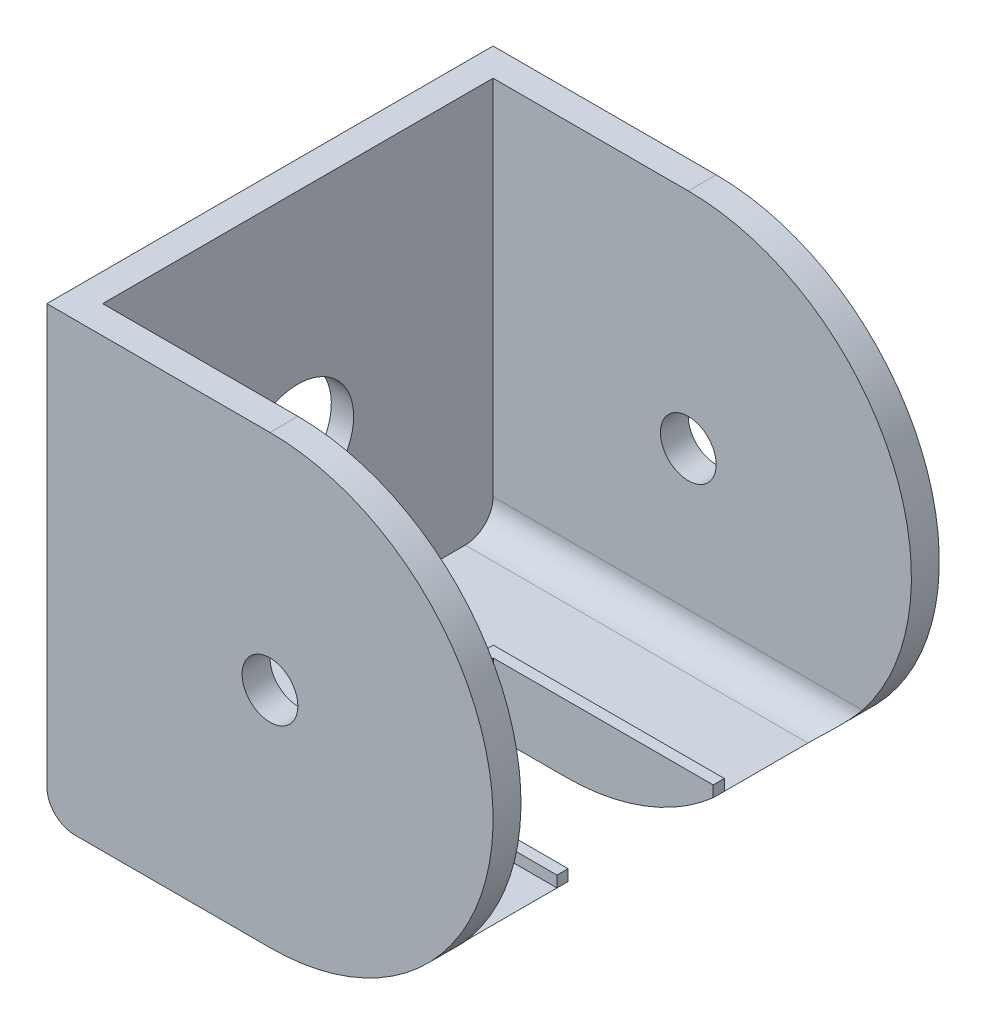
ISO-10303-21;
HEADER;
FILE_DESCRIPTION(('STEP AP214'),'2;1');
FILE_NAME('part.step','',(''),(''),'','','');
FILE_SCHEMA(('AUTOMOTIVE_DESIGN { 1 0 10303 214 1 1 1 1 }'));
ENDSEC;
DATA;
#1=APPLICATION_CONTEXT('core data for automotive mechanical design processes');
#2=APPLICATION_PROTOCOL_DEFINITION('international standard','automotive_design',2000,#1);
#3=PRODUCT_CONTEXT('',#1,'mechanical');
#4=PRODUCT('Part','Part','',(#3));
#5=PRODUCT_RELATED_PRODUCT_CATEGORY('part','',(#4));
#6=PRODUCT_DEFINITION_FORMATION('','',#4);
#7=PRODUCT_DEFINITION_CONTEXT('part definition',#1,'design');
#8=PRODUCT_DEFINITION('design','',#6,#7);
#9=PRODUCT_DEFINITION_SHAPE('','',#8);
#10=(LENGTH_UNIT() NAMED_UNIT(*) SI_UNIT(.MILLI.,.METRE.));
#11=(NAMED_UNIT(*) PLANE_ANGLE_UNIT() SI_UNIT($,.RADIAN.));
#12=(NAMED_UNIT(*) SI_UNIT($,.STERADIAN.) SOLID_ANGLE_UNIT());
#13=UNCERTAINTY_MEASURE_WITH_UNIT(LENGTH_MEASURE(1.E-05),#10,'distance_accuracy_value','');
#14=(GEOMETRIC_REPRESENTATION_CONTEXT(3) GLOBAL_UNCERTAINTY_ASSIGNED_CONTEXT((#13)) GLOBAL_UNIT_ASSIGNED_CONTEXT((#10,
#11,#12)) REPRESENTATION_CONTEXT('',''));
#15=CARTESIAN_POINT('',(0.,0.,0.));
#16=DIRECTION('',(0.,0.,1.));
#17=DIRECTION('',(1.,0.,0.));
#18=AXIS2_PLACEMENT_3D('',#15,#16,#17);
#19=CARTESIAN_POINT('',(-2.70461538461543,-30.,75.));
#20=DIRECTION('',(0.,-1.,0.));
#21=DIRECTION('',(0.,0.,-1.));
#22=AXIS2_PLACEMENT_3D('',#19,#20,#21);
#23=PLANE('',#22);
#24=DIRECTION('',(0.,0.,-1.));
#25=VECTOR('',#24,1.);
#26=CARTESIAN_POINT('',(58.7528977260305,-30.,75.));
#27=LINE('',#26,#25);
#28=CARTESIAN_POINT('',(58.7528977260305,-30.,25.));
#29=VERTEX_POINT('',#28);
#30=CARTESIAN_POINT('',(58.7528977260305,-30.,9.99999999999999));
#31=VERTEX_POINT('',#30);
#32=EDGE_CURVE('E248',#29,#31,#27,.T.);
#33=ORIENTED_EDGE('',*,*,#32,.T.);
#34=DIRECTION('',(-1.,0.,0.));
#35=VECTOR('',#34,1.);
#36=CARTESIAN_POINT('',(-2.70461538461543,-30.,9.99999999999999));
#37=LINE('',#36,#35);
#38=CARTESIAN_POINT('',(-2.70461538461543,-30.,9.99999999999999));
#39=VERTEX_POINT('',#38);
#40=EDGE_CURVE('E325',#31,#39,#37,.T.);
#41=ORIENTED_EDGE('',*,*,#40,.T.);
#42=DIRECTION('',(0.,0.,-1.));
#43=VECTOR('',#42,1.);
#44=CARTESIAN_POINT('',(-2.70461538461543,-30.,75.));
#45=LINE('',#44,#43);
#46=CARTESIAN_POINT('',(-2.70461538461543,-30.,70.));
#47=VERTEX_POINT('',#46);
#48=EDGE_CURVE('E245',#47,#39,#45,.T.);
#49=ORIENTED_EDGE('',*,*,#48,.F.);
#50=DIRECTION('',(-1.,0.,0.));
#51=VECTOR('',#50,1.);
#52=CARTESIAN_POINT('',(-2.70461538461543,-30.,70.));
#53=LINE('',#52,#51);
#54=CARTESIAN_POINT('',(58.7528977260305,-30.,70.));
#55=VERTEX_POINT('',#54);
#56=EDGE_CURVE('E323',#47,#55,#53,.F.);
#57=ORIENTED_EDGE('',*,*,#56,.T.);
#58=CARTESIAN_POINT('',(58.7528977260305,-30.,55.));
#59=VERTEX_POINT('',#58);
#60=EDGE_CURVE('E249',#55,#59,#27,.T.);
#61=ORIENTED_EDGE('',*,*,#60,.T.);
#62=DIRECTION('',(1.,0.,0.));
#63=VECTOR('',#62,1.);
#64=CARTESIAN_POINT('',(58.7528977260305,-30.,55.));
#65=LINE('',#64,#63);
#66=CARTESIAN_POINT('',(17.3396899794099,-30.,55.));
#67=VERTEX_POINT('',#66);
#68=EDGE_CURVE('E208',#67,#59,#65,.T.);
#69=ORIENTED_EDGE('',*,*,#68,.F.);
#70=DIRECTION('',(0.,0.,1.));
#71=VECTOR('',#70,1.);
#72=CARTESIAN_POINT('',(17.3396899794099,-30.,55.));
#73=LINE('',#72,#71);
#74=CARTESIAN_POINT('',(17.3396899794099,-30.,25.));
#75=VERTEX_POINT('',#74);
#76=EDGE_CURVE('E460',#75,#67,#73,.T.);
#77=ORIENTED_EDGE('',*,*,#76,.F.);
#78=DIRECTION('',(-1.,0.,0.));
#79=VECTOR('',#78,1.);
#80=CARTESIAN_POINT('',(17.3396899794099,-30.,25.));
#81=LINE('',#80,#79);
#82=EDGE_CURVE('E458',#29,#75,#81,.T.);
#83=ORIENTED_EDGE('',*,*,#82,.F.);
#84=EDGE_LOOP('',(#33,#41,#49,#57,#61,#69,#77,#83));
#85=FACE_BOUND('',#84,.T.);
#86=ADVANCED_FACE('F44',(#85),#23,.F.);
#87=CARTESIAN_POINT('',(32.2953846153846,0.,5.));
#88=DIRECTION('',(0.,0.,-1.));
#89=DIRECTION('',(-1.,0.,0.));
#90=AXIS2_PLACEMENT_3D('',#87,#88,#89);
#91=CYLINDRICAL_SURFACE('',#90,40.);
#92=CARTESIAN_POINT('',(58.7528977260305,-30.,27.));
#93=VERTEX_POINT('',#92);
#94=EDGE_CURVE('E252',#93,#29,#27,.T.);
#95=ORIENTED_EDGE('',*,*,#94,.F.);
#96=CARTESIAN_POINT('',(32.2953846153846,0.,27.));
#97=DIRECTION('',(0.,0.,-1.));
#98=DIRECTION('',(-1.,0.,0.));
#99=AXIS2_PLACEMENT_3D('',#96,#97,#98);
#100=CIRCLE('',#99,40.);
#101=CARTESIAN_POINT('',(32.2953846153846,-40.,27.));
#102=VERTEX_POINT('',#101);
#103=EDGE_CURVE('E227',#93,#102,#100,.T.);
#104=ORIENTED_EDGE('',*,*,#103,.T.);
#105=DIRECTION('',(0.,0.,-1.));
#106=VECTOR('',#105,1.);
#107=CARTESIAN_POINT('',(32.2953846153846,-40.,5.));
#108=LINE('',#107,#106);
#109=CARTESIAN_POINT('',(32.2953846153846,-40.,0.));
#110=VERTEX_POINT('',#109);
#111=EDGE_CURVE('E308',#102,#110,#108,.T.);
#112=ORIENTED_EDGE('',*,*,#111,.T.);
#113=CARTESIAN_POINT('',(32.2953846153846,0.,0.));
#114=DIRECTION('',(0.,0.,1.));
#115=DIRECTION('',(1.,0.,0.));
#116=AXIS2_PLACEMENT_3D('',#113,#114,#115);
#117=CIRCLE('',#116,40.);
#118=CARTESIAN_POINT('',(32.2953846153846,40.,0.));
#119=VERTEX_POINT('',#118);
#120=EDGE_CURVE('E299',#110,#119,#117,.T.);
#121=ORIENTED_EDGE('',*,*,#120,.T.);
#122=DIRECTION('',(0.,0.,-1.));
#123=VECTOR('',#122,1.);
#124=CARTESIAN_POINT('',(32.2953846153846,40.,5.));
#125=LINE('',#124,#123);
#126=CARTESIAN_POINT('',(32.2953846153846,40.,5.));
#127=VERTEX_POINT('',#126);
#128=EDGE_CURVE('E306',#127,#119,#125,.T.);
#129=ORIENTED_EDGE('',*,*,#128,.F.);
#130=CARTESIAN_POINT('',(32.2953846153846,0.,5.));
#131=DIRECTION('',(0.,0.,1.));
#132=DIRECTION('',(1.,0.,0.));
#133=AXIS2_PLACEMENT_3D('',#130,#131,#132);
#134=CIRCLE('',#133,40.);
#135=CARTESIAN_POINT('',(63.5203746073766,-25.,5.));
#136=VERTEX_POINT('',#135);
#137=EDGE_CURVE('E286',#136,#127,#134,.T.);
#138=ORIENTED_EDGE('',*,*,#137,.F.);
#139=CARTESIAN_POINT('',(63.5203746073766,-25.,5.));
#140=CARTESIAN_POINT('',(63.3885852431773,-25.1646251545152,5.00001957940437));
#141=CARTESIAN_POINT('',(63.2554983068493,-25.3281629039688,5.00812986784931));
#142=CARTESIAN_POINT('',(62.9875617451999,-25.6521768028362,5.04003944373569));
#143=CARTESIAN_POINT('',(62.852712548848,-25.8126536747696,5.06383498031415));
#144=CARTESIAN_POINT('',(62.5810553749061,-26.1308686673881,5.12684689389359));
#145=CARTESIAN_POINT('',(62.444240286586,-26.2885791116842,5.16617198463156));
#146=CARTESIAN_POINT('',(62.1704367686102,-26.5993258334251,5.25990483661994));
#147=CARTESIAN_POINT('',(62.0334483196032,-26.7523615301786,5.3143144632625));
#148=CARTESIAN_POINT('',(61.7442950859481,-27.0705206270654,5.44523471196293));
#149=CARTESIAN_POINT('',(61.5922212118042,-27.2349756111878,5.52358147685888));
#150=CARTESIAN_POINT('',(61.2904165968373,-27.5560643288028,5.69883706245595));
#151=CARTESIAN_POINT('',(61.1406864604896,-27.7126960666944,5.79575058909986));
#152=CARTESIAN_POINT('',(60.8457061244488,-28.0164921579936,6.0081282251765));
#153=CARTESIAN_POINT('',(60.7004456923563,-28.1636791273149,6.1235455137348));
#154=CARTESIAN_POINT('',(60.4163173376673,-28.4473800838824,6.37352864869472));
#155=CARTESIAN_POINT('',(60.2774451230508,-28.5839012814606,6.50808138243117));
#156=CARTESIAN_POINT('',(59.983479710536,-28.8689922717649,6.82440562670511));
#157=CARTESIAN_POINT('',(59.830255858781,-29.0149904374167,7.01029763244727));
#158=CARTESIAN_POINT('',(59.5434759993451,-29.2844693023306,7.41126457065981));
#159=CARTESIAN_POINT('',(59.409891822543,-29.4079823138116,7.62629683894708));
#160=CARTESIAN_POINT('',(59.1971535184453,-29.6025510845106,8.03626883062401));
#161=CARTESIAN_POINT('',(59.112471072184,-29.6791759281358,8.22560770662185));
#162=CARTESIAN_POINT('',(59.0031339074154,-29.7774835939238,8.52133638723915));
#163=CARTESIAN_POINT('',(58.96965529091,-29.8074641932619,8.62178259892865));
#164=CARTESIAN_POINT('',(58.909252522934,-29.861407811779,8.82617622301221));
#165=CARTESIAN_POINT('',(58.8823244695348,-29.8853744135437,8.93012150891989));
#166=CARTESIAN_POINT('',(58.8417434150685,-29.9214198556453,9.11346308221666));
#167=CARTESIAN_POINT('',(58.8264592365768,-29.9349693718543,9.19221541714233));
#168=CARTESIAN_POINT('',(58.8000627737806,-29.9583435028514,9.35095227810625));
#169=CARTESIAN_POINT('',(58.7889495250369,-29.9681689787501,9.43093651483476));
#170=CARTESIAN_POINT('',(58.77102948682,-29.9840020850262,9.59218518230865));
#171=CARTESIAN_POINT('',(58.7642452237779,-29.9899897455521,9.67345409017326));
#172=CARTESIAN_POINT('',(58.7551713768924,-29.9979947813036,9.8364794634789));
#173=CARTESIAN_POINT('',(58.7528841833329,-30.000010045121,9.91823616504953));
#174=CARTESIAN_POINT('',(58.7528977260305,-30.,9.99999999999999));
#175=B_SPLINE_CURVE_WITH_KNOTS('',3,(#139,#140,#141,#142,#143,#144,#145,#146,#147,#148,#149,
#150,#151,#152,#153,#154,#155,#156,#157,#158,#159,#160,#161,#162,#163,#164,#165,#166,#167,#168,
#169,#170,#171,#172,#173,#174),.UNSPECIFIED.,.F.,.F.,(4,2,2,2,2,2,2,2,2,2,2,2,2,2,2,2,2,4),(0.,
0.632420277945506,1.26468937806841,1.90146541807382,2.53832023857879,3.2493576937015,
3.96057560781467,4.67002150382291,5.37898357002722,6.22143887904661,7.06267381547257,
7.72326568764131,8.05304444022069,8.3826262721165,8.62651693104416,8.87035116062598,
9.11544408246242,9.36066724098931),.UNSPECIFIED.);
#176=EDGE_CURVE('E58',#136,#31,#175,.T.);
#177=ORIENTED_EDGE('',*,*,#176,.T.);
#178=ORIENTED_EDGE('',*,*,#32,.F.);
#179=EDGE_LOOP('',(#95,#104,#112,#121,#129,#138,#177,#178));
#180=FACE_BOUND('',#179,.T.);
#181=ADVANCED_FACE('F367',(#180),#91,.T.);
#182=CARTESIAN_POINT('',(-2.70461538461543,0.,40.));
#183=DIRECTION('',(-1.,0.,0.));
#184=DIRECTION('',(0.,-1.,0.));
#185=AXIS2_PLACEMENT_3D('',#182,#183,#184);
#186=CYLINDRICAL_SURFACE('',#185,10.);
#187=CARTESIAN_POINT('',(-2.70461538461543,0.,40.));
#188=DIRECTION('',(-1.,0.,0.));
#189=DIRECTION('',(0.,-1.,0.));
#190=AXIS2_PLACEMENT_3D('',#187,#188,#189);
#191=CIRCLE('',#190,10.);
#192=CARTESIAN_POINT('',(-2.70461538461542,-10.,40.));
#193=VERTEX_POINT('',#192);
#194=EDGE_CURVE('E242',#193,#193,#191,.T.);
#195=ORIENTED_EDGE('',*,*,#194,.F.);
#196=EDGE_LOOP('',(#195));
#197=FACE_BOUND('',#196,.T.);
#198=CARTESIAN_POINT('',(-6.70461538461543,0.,40.));
#199=DIRECTION('',(-1.,0.,0.));
#200=DIRECTION('',(0.,-1.,0.));
#201=AXIS2_PLACEMENT_3D('',#198,#199,#200);
#202=CIRCLE('',#201,10.);
#203=CARTESIAN_POINT('',(-6.70461538461543,-10.,40.));
#204=VERTEX_POINT('',#203);
#205=EDGE_CURVE('E239',#204,#204,#202,.F.);
#206=ORIENTED_EDGE('',*,*,#205,.F.);
#207=EDGE_LOOP('',(#206));
#208=FACE_BOUND('',#207,.T.);
#209=ADVANCED_FACE('F375',(#197,#208),#186,.F.);
#210=CARTESIAN_POINT('',(0.,0.,5.));
#211=DIRECTION('',(0.,0.,1.));
#212=DIRECTION('',(1.,0.,0.));
#213=AXIS2_PLACEMENT_3D('',#210,#211,#212);
#214=PLANE('',#213);
#215=CARTESIAN_POINT('',(32.2953846153846,0.,5.));
#216=DIRECTION('',(0.,0.,1.));
#217=DIRECTION('',(1.,0.,0.));
#218=AXIS2_PLACEMENT_3D('',#215,#216,#217);
#219=CIRCLE('',#218,5.);
#220=CARTESIAN_POINT('',(37.2953846153846,0.,5.));
#221=VERTEX_POINT('',#220);
#222=EDGE_CURVE('E283',#221,#221,#219,.T.);
#223=ORIENTED_EDGE('',*,*,#222,.F.);
#224=EDGE_LOOP('',(#223));
#225=FACE_BOUND('',#224,.T.);
#226=DIRECTION('',(0.,1.,0.));
#227=VECTOR('',#226,1.);
#228=CARTESIAN_POINT('',(-2.70461538461543,40.,5.));
#229=LINE('',#228,#227);
#230=CARTESIAN_POINT('',(-2.70461538461542,-25.,5.));
#231=VERTEX_POINT('',#230);
#232=CARTESIAN_POINT('',(-2.70461538461543,40.,5.));
#233=VERTEX_POINT('',#232);
#234=EDGE_CURVE('E275',#231,#233,#229,.T.);
#235=ORIENTED_EDGE('',*,*,#234,.F.);
#236=DIRECTION('',(-1.,0.,0.));
#237=VECTOR('',#236,1.);
#238=CARTESIAN_POINT('',(0.,-25.,5.));
#239=LINE('',#238,#237);
#240=EDGE_CURVE('E71',#231,#136,#239,.F.);
#241=ORIENTED_EDGE('',*,*,#240,.T.);
#242=ORIENTED_EDGE('',*,*,#137,.T.);
#243=DIRECTION('',(1.,0.,0.));
#244=VECTOR('',#243,1.);
#245=CARTESIAN_POINT('',(0.,40.,5.));
#246=LINE('',#245,#244);
#247=EDGE_CURVE('E289',#233,#127,#246,.T.);
#248=ORIENTED_EDGE('',*,*,#247,.F.);
#249=EDGE_LOOP('',(#235,#241,#242,#248));
#250=FACE_BOUND('',#249,.T.);
#251=ADVANCED_FACE('F397',(#225,#250),#214,.T.);
#252=CARTESIAN_POINT('',(-2.70461538461543,40.,75.));
#253=DIRECTION('',(-1.,0.,0.));
#254=DIRECTION('',(0.,-1.,0.));
#255=AXIS2_PLACEMENT_3D('',#252,#253,#254);
#256=PLANE('',#255);
#257=ORIENTED_EDGE('',*,*,#194,.T.);
#258=EDGE_LOOP('',(#257));
#259=FACE_BOUND('',#258,.T.);
#260=ORIENTED_EDGE('',*,*,#48,.T.);
#261=CARTESIAN_POINT('',(-2.70461538461542,-25.,9.99999999999999));
#262=DIRECTION('',(-1.,0.,0.));
#263=DIRECTION('',(0.,-1.,0.));
#264=AXIS2_PLACEMENT_3D('',#261,#262,#263);
#265=CIRCLE('',#264,5.);
#266=EDGE_CURVE('E330',#39,#231,#265,.F.);
#267=ORIENTED_EDGE('',*,*,#266,.T.);
#268=ORIENTED_EDGE('',*,*,#234,.T.);
#269=DIRECTION('',(0.,0.,-1.));
#270=VECTOR('',#269,1.);
#271=CARTESIAN_POINT('',(-2.70461538461543,40.,75.));
#272=LINE('',#271,#270);
#273=CARTESIAN_POINT('',(-2.70461538461543,40.,75.));
#274=VERTEX_POINT('',#273);
#275=EDGE_CURVE('E278',#274,#233,#272,.T.);
#276=ORIENTED_EDGE('',*,*,#275,.F.);
#277=DIRECTION('',(0.,1.,0.));
#278=VECTOR('',#277,1.);
#279=CARTESIAN_POINT('',(-2.70461538461543,40.,75.));
#280=LINE('',#279,#278);
#281=CARTESIAN_POINT('',(-2.70461538461542,-25.,75.));
#282=VERTEX_POINT('',#281);
#283=EDGE_CURVE('E276',#282,#274,#280,.T.);
#284=ORIENTED_EDGE('',*,*,#283,.F.);
#285=CARTESIAN_POINT('',(-2.70461538461542,-25.,70.));
#286=DIRECTION('',(-1.,0.,0.));
#287=DIRECTION('',(0.,-1.,0.));
#288=AXIS2_PLACEMENT_3D('',#285,#286,#287);
#289=CIRCLE('',#288,5.);
#290=EDGE_CURVE('E328',#282,#47,#289,.F.);
#291=ORIENTED_EDGE('',*,*,#290,.T.);
#292=EDGE_LOOP('',(#260,#267,#268,#276,#284,#291));
#293=FACE_BOUND('',#292,.T.);
#294=ADVANCED_FACE('F383',(#259,#293),#256,.F.);
#295=CARTESIAN_POINT('',(0.,0.,75.));
#296=DIRECTION('',(0.,0.,-1.));
#297=DIRECTION('',(1.,0.,0.));
#298=AXIS2_PLACEMENT_3D('',#295,#296,#297);
#299=PLANE('',#298);
#300=CARTESIAN_POINT('',(32.2953846153846,0.,75.));
#301=DIRECTION('',(0.,0.,1.));
#302=DIRECTION('',(1.,0.,0.));
#303=AXIS2_PLACEMENT_3D('',#300,#301,#302);
#304=CIRCLE('',#303,5.);
#305=CARTESIAN_POINT('',(37.2953846153846,0.,75.));
#306=VERTEX_POINT('',#305);
#307=EDGE_CURVE('E253',#306,#306,#304,.T.);
#308=ORIENTED_EDGE('',*,*,#307,.T.);
#309=EDGE_LOOP('',(#308));
#310=FACE_BOUND('',#309,.T.);
#311=CARTESIAN_POINT('',(32.2953846153846,0.,75.));
#312=DIRECTION('',(0.,0.,1.));
#313=DIRECTION('',(1.,0.,0.));
#314=AXIS2_PLACEMENT_3D('',#311,#312,#313);
#315=CIRCLE('',#314,40.);
#316=CARTESIAN_POINT('',(63.5203746073766,-25.,75.));
#317=VERTEX_POINT('',#316);
#318=CARTESIAN_POINT('',(32.2953846153846,40.,75.));
#319=VERTEX_POINT('',#318);
#320=EDGE_CURVE('E260',#317,#319,#315,.T.);
#321=ORIENTED_EDGE('',*,*,#320,.F.);
#322=DIRECTION('',(-1.,0.,0.));
#323=VECTOR('',#322,1.);
#324=CARTESIAN_POINT('',(0.,-25.,75.));
#325=LINE('',#324,#323);
#326=EDGE_CURVE('E333',#317,#282,#325,.T.);
#327=ORIENTED_EDGE('',*,*,#326,.T.);
#328=ORIENTED_EDGE('',*,*,#283,.T.);
#329=DIRECTION('',(1.,0.,0.));
#330=VECTOR('',#329,1.);
#331=CARTESIAN_POINT('',(0.,40.,75.));
#332=LINE('',#331,#330);
#333=EDGE_CURVE('E256',#274,#319,#332,.T.);
#334=ORIENTED_EDGE('',*,*,#333,.T.);
#335=EDGE_LOOP('',(#321,#327,#328,#334));
#336=FACE_BOUND('',#335,.T.);
#337=ADVANCED_FACE('F360',(#310,#336),#299,.T.);
#338=CARTESIAN_POINT('',(-7.70461538461543,0.,5.));
#339=DIRECTION('',(-1.,0.,0.));
#340=DIRECTION('',(0.,-1.,0.));
#341=AXIS2_PLACEMENT_3D('',#338,#339,#340);
#342=PLANE('',#341);
#343=CARTESIAN_POINT('',(-7.70461538461543,0.,40.));
#344=DIRECTION('',(-1.,0.,0.));
#345=DIRECTION('',(0.,-1.,0.));
#346=AXIS2_PLACEMENT_3D('',#343,#344,#345);
#347=CIRCLE('',#346,20.);
#348=CARTESIAN_POINT('',(-7.70461538461542,-20.,40.));
#349=VERTEX_POINT('',#348);
#350=EDGE_CURVE('E235',#349,#349,#347,.T.);
#351=ORIENTED_EDGE('',*,*,#350,.F.);
#352=EDGE_LOOP('',(#351));
#353=FACE_BOUND('',#352,.T.);
#354=DIRECTION('',(0.,1.,0.));
#355=VECTOR('',#354,1.);
#356=CARTESIAN_POINT('',(-7.70461538461543,0.,0.));
#357=LINE('',#356,#355);
#358=CARTESIAN_POINT('',(-7.70461538461542,-35.,0.));
#359=VERTEX_POINT('',#358);
#360=CARTESIAN_POINT('',(-7.70461538461543,40.,0.));
#361=VERTEX_POINT('',#360);
#362=EDGE_CURVE('E295',#359,#361,#357,.T.);
#363=ORIENTED_EDGE('',*,*,#362,.F.);
#364=DIRECTION('',(0.,0.,-1.));
#365=VECTOR('',#364,1.);
#366=CARTESIAN_POINT('',(-7.70461538461542,-35.,80.));
#367=LINE('',#366,#365);
#368=CARTESIAN_POINT('',(-7.70461538461542,-35.,80.));
#369=VERTEX_POINT('',#368);
#370=EDGE_CURVE('E319',#359,#369,#367,.F.);
#371=ORIENTED_EDGE('',*,*,#370,.T.);
#372=DIRECTION('',(0.,1.,0.));
#373=VECTOR('',#372,1.);
#374=CARTESIAN_POINT('',(-7.70461538461543,0.,80.));
#375=LINE('',#374,#373);
#376=CARTESIAN_POINT('',(-7.70461538461543,40.,80.));
#377=VERTEX_POINT('',#376);
#378=EDGE_CURVE('E265',#369,#377,#375,.T.);
#379=ORIENTED_EDGE('',*,*,#378,.T.);
#380=DIRECTION('',(0.,0.,-1.));
#381=VECTOR('',#380,1.);
#382=CARTESIAN_POINT('',(-7.70461538461543,40.,5.));
#383=LINE('',#382,#381);
#384=EDGE_CURVE('E292',#377,#361,#383,.T.);
#385=ORIENTED_EDGE('',*,*,#384,.T.);
#386=EDGE_LOOP('',(#363,#371,#379,#385));
#387=FACE_BOUND('',#386,.T.);
#388=ADVANCED_FACE('F357',(#353,#387),#342,.T.);
#389=CARTESIAN_POINT('',(0.,-40.,5.));
#390=DIRECTION('',(0.,1.,0.));
#391=DIRECTION('',(0.,0.,1.));
#392=AXIS2_PLACEMENT_3D('',#389,#390,#391);
#393=PLANE('',#392);
#394=DIRECTION('',(1.,0.,0.));
#395=VECTOR('',#394,1.);
#396=CARTESIAN_POINT('',(0.,-40.,80.));
#397=LINE('',#396,#395);
#398=CARTESIAN_POINT('',(-2.70461538461542,-40.,80.));
#399=VERTEX_POINT('',#398);
#400=CARTESIAN_POINT('',(32.2953846153846,-40.,80.));
#401=VERTEX_POINT('',#400);
#402=EDGE_CURVE('E257',#399,#401,#397,.T.);
#403=ORIENTED_EDGE('',*,*,#402,.F.);
#404=DIRECTION('',(0.,0.,-1.));
#405=VECTOR('',#404,1.);
#406=CARTESIAN_POINT('',(-2.70461538461542,-40.,0.));
#407=LINE('',#406,#405);
#408=CARTESIAN_POINT('',(-2.70461538461542,-40.,0.));
#409=VERTEX_POINT('',#408);
#410=EDGE_CURVE('E312',#399,#409,#407,.T.);
#411=ORIENTED_EDGE('',*,*,#410,.T.);
#412=DIRECTION('',(1.,0.,0.));
#413=VECTOR('',#412,1.);
#414=CARTESIAN_POINT('',(0.,-40.,0.));
#415=LINE('',#414,#413);
#416=EDGE_CURVE('E297',#409,#110,#415,.T.);
#417=ORIENTED_EDGE('',*,*,#416,.T.);
#418=ORIENTED_EDGE('',*,*,#111,.F.);
#419=DIRECTION('',(-1.,0.,0.));
#420=VECTOR('',#419,1.);
#421=CARTESIAN_POINT('',(0.,-40.,27.));
#422=LINE('',#421,#420);
#423=CARTESIAN_POINT('',(19.3396899794099,-40.,27.));
#424=VERTEX_POINT('',#423);
#425=EDGE_CURVE('E230',#102,#424,#422,.T.);
#426=ORIENTED_EDGE('',*,*,#425,.T.);
#427=DIRECTION('',(0.,0.,-1.));
#428=VECTOR('',#427,1.);
#429=CARTESIAN_POINT('',(19.3396899794099,-40.,5.));
#430=LINE('',#429,#428);
#431=CARTESIAN_POINT('',(19.3396899794099,-40.,53.));
#432=VERTEX_POINT('',#431);
#433=EDGE_CURVE('E233',#432,#424,#430,.T.);
#434=ORIENTED_EDGE('',*,*,#433,.F.);
#435=DIRECTION('',(1.,0.,0.));
#436=VECTOR('',#435,1.);
#437=CARTESIAN_POINT('',(0.,-40.,53.));
#438=LINE('',#437,#436);
#439=CARTESIAN_POINT('',(32.2953846153846,-40.,53.));
#440=VERTEX_POINT('',#439);
#441=EDGE_CURVE('E224',#432,#440,#438,.T.);
#442=ORIENTED_EDGE('',*,*,#441,.T.);
#443=EDGE_CURVE('E309',#401,#440,#108,.T.);
#444=ORIENTED_EDGE('',*,*,#443,.F.);
#445=EDGE_LOOP('',(#403,#411,#417,#418,#426,#434,#442,#444));
#446=FACE_BOUND('',#445,.T.);
#447=ADVANCED_FACE('F359',(#446),#393,.F.);
#448=ORIENTED_EDGE('',*,*,#443,.T.);
#449=CARTESIAN_POINT('',(32.2953846153846,0.,53.));
#450=DIRECTION('',(0.,0.,1.));
#451=DIRECTION('',(1.,0.,0.));
#452=AXIS2_PLACEMENT_3D('',#449,#450,#451);
#453=CIRCLE('',#452,40.);
#454=CARTESIAN_POINT('',(58.7528977260305,-30.,53.));
#455=VERTEX_POINT('',#454);
#456=EDGE_CURVE('E221',#440,#455,#453,.T.);
#457=ORIENTED_EDGE('',*,*,#456,.T.);
#458=DIRECTION('',(0.,0.,-1.));
#459=VECTOR('',#458,1.);
#460=CARTESIAN_POINT('',(58.7528977260305,-30.,55.));
#461=LINE('',#460,#459);
#462=EDGE_CURVE('E212',#59,#455,#461,.T.);
#463=ORIENTED_EDGE('',*,*,#462,.F.);
#464=ORIENTED_EDGE('',*,*,#60,.F.);
#465=CARTESIAN_POINT('',(58.7528977260305,-30.,70.));
#466=CARTESIAN_POINT('',(58.7528555066944,-30.0000312253274,70.1099134001894));
#467=CARTESIAN_POINT('',(58.757005804066,-29.9963769124436,70.2197962463042));
#468=CARTESIAN_POINT('',(58.7733650433603,-29.981940676254,70.438366580686));
#469=CARTESIAN_POINT('',(58.7855647753652,-29.9711668988011,70.547055290926));
#470=CARTESIAN_POINT('',(58.8175249792562,-29.9428871567715,70.7612004534142));
#471=CARTESIAN_POINT('',(58.8372026845642,-29.9254548783902,70.8666791011047));
#472=CARTESIAN_POINT('',(58.883570348122,-29.8842658705033,71.0748097184949));
#473=CARTESIAN_POINT('',(58.9102618986162,-29.8605077049137,71.1774610404973));
#474=CARTESIAN_POINT('',(58.9996486564265,-29.7806754659625,71.4792615841707));
#475=CARTESIAN_POINT('',(59.0718377627708,-29.7158846974633,71.6734027926141));
#476=CARTESIAN_POINT('',(59.236214704727,-29.5669414993549,72.0453522639651));
#477=CARTESIAN_POINT('',(59.3284623805489,-29.4827310891075,72.2231093390557));
#478=CARTESIAN_POINT('',(59.5790460954707,-29.2513848050805,72.6477110507648));
#479=CARTESIAN_POINT('',(59.7470514447112,-29.0940946506917,72.8833873077963));
#480=CARTESIAN_POINT('',(60.0148849859842,-28.8382532805617,73.2073102219115));
#481=CARTESIAN_POINT('',(60.1069475945031,-28.7495098228166,73.3104825250282));
#482=CARTESIAN_POINT('',(60.2953193504673,-28.5660790069362,73.5073001112186));
#483=CARTESIAN_POINT('',(60.3916284150687,-28.4713917647423,73.6009455800327));
#484=CARTESIAN_POINT('',(60.6228852345278,-28.2416010318883,73.8110724690073));
#485=CARTESIAN_POINT('',(60.7592189646224,-28.1042574136947,73.9235770390699));
#486=CARTESIAN_POINT('',(61.0359755871258,-27.8211726134206,74.1318111573375));
#487=CARTESIAN_POINT('',(61.1763999840666,-27.6754283218138,74.2275344402381));
#488=CARTESIAN_POINT('',(61.4597650007353,-27.3766563958278,74.4024389088347));
#489=CARTESIAN_POINT('',(61.6027057295011,-27.2236284453408,74.4816193757741));
#490=CARTESIAN_POINT('',(61.8897959261628,-26.9112578790255,74.6234734347586));
#491=CARTESIAN_POINT('',(62.0339451144098,-26.7519166939815,74.6861507426154));
#492=CARTESIAN_POINT('',(62.2913014237543,-26.4626902225517,74.7831500948754));
#493=CARTESIAN_POINT('',(62.4044887416286,-26.3338488519452,74.8206716658907));
#494=CARTESIAN_POINT('',(62.6304397775708,-26.0732461630975,74.8853003920946));
#495=CARTESIAN_POINT('',(62.7432035660994,-25.9414853582271,74.9124093631641));
#496=CARTESIAN_POINT('',(62.967497785814,-25.6758944476578,74.9559280202637));
#497=CARTESIAN_POINT('',(63.0790309870243,-25.5420721890263,74.9723712176379));
#498=CARTESIAN_POINT('',(63.3007989349725,-25.2724137275916,74.9944042229532));
#499=CARTESIAN_POINT('',(63.4110333141207,-25.1365769781066,74.9999910283551));
#500=CARTESIAN_POINT('',(63.5203746073766,-25.,75.));
#501=B_SPLINE_CURVE_WITH_KNOTS('',3,(#465,#466,#467,#468,#469,#470,#471,#472,#473,#474,#475,
#476,#477,#478,#479,#480,#481,#482,#483,#484,#485,#486,#487,#488,#489,#490,#491,#492,#493,#494,
#495,#496,#497,#498,#499,#500),.UNSPECIFIED.,.F.,.F.,(4,2,2,2,2,2,2,2,2,2,2,2,2,2,2,2,2,4),(0.,
0.329551824556709,0.658727238310916,0.984360700990566,1.31006815113459,1.95801951668292,
2.60793108845708,3.59027060667414,4.08289222531556,4.57550423769225,5.24613230345552,
5.91701021787048,6.58791727470201,7.25867314227898,7.7850211794903,8.31127738375671,
8.83587200290258,9.36061168791746),.UNSPECIFIED.);
#502=EDGE_CURVE('E11',#55,#317,#501,.T.);
#503=ORIENTED_EDGE('',*,*,#502,.T.);
#504=ORIENTED_EDGE('',*,*,#320,.T.);
#505=DIRECTION('',(0.,0.,1.));
#506=VECTOR('',#505,1.);
#507=CARTESIAN_POINT('',(32.2953846153846,40.,75.));
#508=LINE('',#507,#506);
#509=CARTESIAN_POINT('',(32.2953846153846,40.,80.));
#510=VERTEX_POINT('',#509);
#511=EDGE_CURVE('E262',#319,#510,#508,.T.);
#512=ORIENTED_EDGE('',*,*,#511,.T.);
#513=CARTESIAN_POINT('',(32.2953846153846,0.,80.));
#514=DIRECTION('',(0.,0.,1.));
#515=DIRECTION('',(1.,0.,0.));
#516=AXIS2_PLACEMENT_3D('',#513,#514,#515);
#517=CIRCLE('',#516,40.);
#518=EDGE_CURVE('E270',#401,#510,#517,.T.);
#519=ORIENTED_EDGE('',*,*,#518,.F.);
#520=EDGE_LOOP('',(#448,#457,#463,#464,#503,#504,#512,#519));
#521=FACE_BOUND('',#520,.T.);
#522=ADVANCED_FACE('F339',(#521),#91,.T.);
#523=CARTESIAN_POINT('',(32.2953846153846,0.,5.));
#524=DIRECTION('',(0.,0.,-1.));
#525=DIRECTION('',(-1.,0.,0.));
#526=AXIS2_PLACEMENT_3D('',#523,#524,#525);
#527=CYLINDRICAL_SURFACE('',#526,5.);
#528=ORIENTED_EDGE('',*,*,#222,.T.);
#529=EDGE_LOOP('',(#528));
#530=FACE_BOUND('',#529,.T.);
#531=CARTESIAN_POINT('',(32.2953846153846,0.,0.));
#532=DIRECTION('',(0.,0.,1.));
#533=DIRECTION('',(1.,0.,0.));
#534=AXIS2_PLACEMENT_3D('',#531,#532,#533);
#535=CIRCLE('',#534,5.);
#536=CARTESIAN_POINT('',(37.2953846153846,0.,0.));
#537=VERTEX_POINT('',#536);
#538=EDGE_CURVE('E282',#537,#537,#535,.T.);
#539=ORIENTED_EDGE('',*,*,#538,.F.);
#540=EDGE_LOOP('',(#539));
#541=FACE_BOUND('',#540,.T.);
#542=ADVANCED_FACE('F352',(#530,#541),#527,.F.);
#543=CARTESIAN_POINT('',(0.,40.,5.));
#544=DIRECTION('',(0.,1.,0.));
#545=DIRECTION('',(0.,0.,1.));
#546=AXIS2_PLACEMENT_3D('',#543,#544,#545);
#547=PLANE('',#546);
#548=DIRECTION('',(1.,0.,0.));
#549=VECTOR('',#548,1.);
#550=CARTESIAN_POINT('',(0.,40.,0.));
#551=LINE('',#550,#549);
#552=EDGE_CURVE('E287',#361,#119,#551,.T.);
#553=ORIENTED_EDGE('',*,*,#552,.F.);
#554=ORIENTED_EDGE('',*,*,#384,.F.);
#555=DIRECTION('',(1.,0.,0.));
#556=VECTOR('',#555,1.);
#557=CARTESIAN_POINT('',(0.,40.,80.));
#558=LINE('',#557,#556);
#559=EDGE_CURVE('E267',#377,#510,#558,.T.);
#560=ORIENTED_EDGE('',*,*,#559,.T.);
#561=ORIENTED_EDGE('',*,*,#511,.F.);
#562=ORIENTED_EDGE('',*,*,#333,.F.);
#563=ORIENTED_EDGE('',*,*,#275,.T.);
#564=ORIENTED_EDGE('',*,*,#247,.T.);
#565=ORIENTED_EDGE('',*,*,#128,.T.);
#566=EDGE_LOOP('',(#553,#554,#560,#561,#562,#563,#564,#565));
#567=FACE_BOUND('',#566,.T.);
#568=ADVANCED_FACE('F355',(#567),#547,.T.);
#569=CARTESIAN_POINT('',(0.,0.,0.));
#570=DIRECTION('',(0.,0.,1.));
#571=DIRECTION('',(1.,0.,0.));
#572=AXIS2_PLACEMENT_3D('',#569,#570,#571);
#573=PLANE('',#572);
#574=ORIENTED_EDGE('',*,*,#538,.T.);
#575=EDGE_LOOP('',(#574));
#576=FACE_BOUND('',#575,.T.);
#577=ORIENTED_EDGE('',*,*,#416,.F.);
#578=CARTESIAN_POINT('',(-2.70461538461542,-35.,0.));
#579=DIRECTION('',(0.,0.,1.));
#580=DIRECTION('',(1.,0.,0.));
#581=AXIS2_PLACEMENT_3D('',#578,#579,#580);
#582=CIRCLE('',#581,5.);
#583=EDGE_CURVE('E317',#409,#359,#582,.F.);
#584=ORIENTED_EDGE('',*,*,#583,.T.);
#585=ORIENTED_EDGE('',*,*,#362,.T.);
#586=ORIENTED_EDGE('',*,*,#552,.T.);
#587=ORIENTED_EDGE('',*,*,#120,.F.);
#588=EDGE_LOOP('',(#577,#584,#585,#586,#587));
#589=FACE_BOUND('',#588,.T.);
#590=ADVANCED_FACE('F393',(#576,#589),#573,.F.);
#591=CARTESIAN_POINT('',(32.2953846153846,0.,75.));
#592=DIRECTION('',(0.,0.,1.));
#593=DIRECTION('',(1.,0.,0.));
#594=AXIS2_PLACEMENT_3D('',#591,#592,#593);
#595=CYLINDRICAL_SURFACE('',#594,5.);
#596=ORIENTED_EDGE('',*,*,#307,.F.);
#597=EDGE_LOOP('',(#596));
#598=FACE_BOUND('',#597,.T.);
#599=CARTESIAN_POINT('',(32.2953846153846,0.,80.));
#600=DIRECTION('',(0.,0.,1.));
#601=DIRECTION('',(1.,0.,0.));
#602=AXIS2_PLACEMENT_3D('',#599,#600,#601);
#603=CIRCLE('',#602,5.);
#604=CARTESIAN_POINT('',(37.2953846153846,0.,80.));
#605=VERTEX_POINT('',#604);
#606=EDGE_CURVE('E251',#605,#605,#603,.T.);
#607=ORIENTED_EDGE('',*,*,#606,.T.);
#608=EDGE_LOOP('',(#607));
#609=FACE_BOUND('',#608,.T.);
#610=ADVANCED_FACE('F389',(#598,#609),#595,.F.);
#611=CARTESIAN_POINT('',(0.,0.,80.));
#612=DIRECTION('',(0.,0.,-1.));
#613=DIRECTION('',(1.,0.,0.));
#614=AXIS2_PLACEMENT_3D('',#611,#612,#613);
#615=PLANE('',#614);
#616=ORIENTED_EDGE('',*,*,#606,.F.);
#617=EDGE_LOOP('',(#616));
#618=FACE_BOUND('',#617,.T.);
#619=ORIENTED_EDGE('',*,*,#378,.F.);
#620=CARTESIAN_POINT('',(-2.70461538461542,-35.,80.));
#621=DIRECTION('',(0.,0.,-1.));
#622=DIRECTION('',(-1.,0.,0.));
#623=AXIS2_PLACEMENT_3D('',#620,#621,#622);
#624=CIRCLE('',#623,5.);
#625=EDGE_CURVE('E321',#369,#399,#624,.F.);
#626=ORIENTED_EDGE('',*,*,#625,.T.);
#627=ORIENTED_EDGE('',*,*,#402,.T.);
#628=ORIENTED_EDGE('',*,*,#518,.T.);
#629=ORIENTED_EDGE('',*,*,#559,.F.);
#630=EDGE_LOOP('',(#619,#626,#627,#628,#629));
#631=FACE_BOUND('',#630,.T.);
#632=ADVANCED_FACE('F385',(#618,#631),#615,.F.);
#633=CARTESIAN_POINT('',(-6.70461538461543,0.,40.));
#634=DIRECTION('',(-1.,0.,0.));
#635=DIRECTION('',(0.,-1.,0.));
#636=AXIS2_PLACEMENT_3D('',#633,#634,#635);
#637=PLANE('',#636);
#638=CARTESIAN_POINT('',(-6.70461538461543,0.,40.));
#639=DIRECTION('',(-1.,0.,0.));
#640=DIRECTION('',(0.,-1.,0.));
#641=AXIS2_PLACEMENT_3D('',#638,#639,#640);
#642=CIRCLE('',#641,20.);
#643=CARTESIAN_POINT('',(-6.70461538461542,-20.,40.));
#644=VERTEX_POINT('',#643);
#645=EDGE_CURVE('E236',#644,#644,#642,.T.);
#646=ORIENTED_EDGE('',*,*,#645,.T.);
#647=EDGE_LOOP('',(#646));
#648=FACE_BOUND('',#647,.T.);
#649=ORIENTED_EDGE('',*,*,#205,.T.);
#650=EDGE_LOOP('',(#649));
#651=FACE_BOUND('',#650,.T.);
#652=ADVANCED_FACE('F388',(#648,#651),#637,.T.);
#653=CARTESIAN_POINT('',(-6.70461538461543,0.,40.));
#654=DIRECTION('',(-1.,0.,0.));
#655=DIRECTION('',(0.,-1.,0.));
#656=AXIS2_PLACEMENT_3D('',#653,#654,#655);
#657=CYLINDRICAL_SURFACE('',#656,20.);
#658=ORIENTED_EDGE('',*,*,#645,.F.);
#659=EDGE_LOOP('',(#658));
#660=FACE_BOUND('',#659,.T.);
#661=ORIENTED_EDGE('',*,*,#350,.T.);
#662=EDGE_LOOP('',(#661));
#663=FACE_BOUND('',#662,.T.);
#664=ADVANCED_FACE('F559',(#660,#663),#657,.F.);
#665=CARTESIAN_POINT('',(19.3396899794099,-49.,0.));
#666=DIRECTION('',(1.,0.,0.));
#667=DIRECTION('',(0.,0.,-1.));
#668=AXIS2_PLACEMENT_3D('',#665,#666,#667);
#669=PLANE('',#668);
#670=ORIENTED_EDGE('',*,*,#433,.T.);
#671=DIRECTION('',(0.,1.,0.));
#672=VECTOR('',#671,1.);
#673=CARTESIAN_POINT('',(19.3396899794099,-49.,27.));
#674=LINE('',#673,#672);
#675=CARTESIAN_POINT('',(19.3396899794099,-28.,27.));
#676=VERTEX_POINT('',#675);
#677=EDGE_CURVE('E215',#424,#676,#674,.T.);
#678=ORIENTED_EDGE('',*,*,#677,.T.);
#679=DIRECTION('',(0.,0.,-1.));
#680=VECTOR('',#679,1.);
#681=CARTESIAN_POINT('',(19.3396899794099,-28.,53.));
#682=LINE('',#681,#680);
#683=CARTESIAN_POINT('',(19.3396899794099,-28.,53.));
#684=VERTEX_POINT('',#683);
#685=EDGE_CURVE('E198',#684,#676,#682,.T.);
#686=ORIENTED_EDGE('',*,*,#685,.F.);
#687=DIRECTION('',(0.,1.,0.));
#688=VECTOR('',#687,1.);
#689=CARTESIAN_POINT('',(19.3396899794099,-49.,53.));
#690=LINE('',#689,#688);
#691=EDGE_CURVE('E194',#432,#684,#690,.T.);
#692=ORIENTED_EDGE('',*,*,#691,.F.);
#693=EDGE_LOOP('',(#670,#678,#686,#692));
#694=FACE_BOUND('',#693,.T.);
#695=ADVANCED_FACE('F445',(#694),#669,.T.);
#696=CARTESIAN_POINT('',(0.,-49.,27.));
#697=DIRECTION('',(0.,0.,-1.));
#698=DIRECTION('',(-1.,0.,0.));
#699=AXIS2_PLACEMENT_3D('',#696,#697,#698);
#700=PLANE('',#699);
#701=ORIENTED_EDGE('',*,*,#103,.F.);
#702=DIRECTION('',(0.,-1.,0.));
#703=VECTOR('',#702,1.);
#704=CARTESIAN_POINT('',(58.7528977260305,-28.,27.));
#705=LINE('',#704,#703);
#706=CARTESIAN_POINT('',(58.7528977260305,-28.,27.));
#707=VERTEX_POINT('',#706);
#708=EDGE_CURVE('E213',#707,#93,#705,.T.);
#709=ORIENTED_EDGE('',*,*,#708,.F.);
#710=DIRECTION('',(1.,0.,0.));
#711=VECTOR('',#710,1.);
#712=CARTESIAN_POINT('',(19.3396899794099,-28.,27.));
#713=LINE('',#712,#711);
#714=EDGE_CURVE('E443',#676,#707,#713,.T.);
#715=ORIENTED_EDGE('',*,*,#714,.F.);
#716=ORIENTED_EDGE('',*,*,#677,.F.);
#717=ORIENTED_EDGE('',*,*,#425,.F.);
#718=EDGE_LOOP('',(#701,#709,#715,#716,#717));
#719=FACE_BOUND('',#718,.T.);
#720=ADVANCED_FACE('F440',(#719),#700,.F.);
#721=CARTESIAN_POINT('',(0.,-49.,53.));
#722=DIRECTION('',(0.,0.,1.));
#723=DIRECTION('',(1.,0.,0.));
#724=AXIS2_PLACEMENT_3D('',#721,#722,#723);
#725=PLANE('',#724);
#726=ORIENTED_EDGE('',*,*,#691,.T.);
#727=DIRECTION('',(-1.,0.,0.));
#728=VECTOR('',#727,1.);
#729=CARTESIAN_POINT('',(58.7528977260305,-28.,53.));
#730=LINE('',#729,#728);
#731=CARTESIAN_POINT('',(58.7528977260305,-28.,53.));
#732=VERTEX_POINT('',#731);
#733=EDGE_CURVE('E187',#732,#684,#730,.T.);
#734=ORIENTED_EDGE('',*,*,#733,.F.);
#735=DIRECTION('',(0.,-1.,0.));
#736=VECTOR('',#735,1.);
#737=CARTESIAN_POINT('',(58.7528977260305,-28.,53.));
#738=LINE('',#737,#736);
#739=EDGE_CURVE('E191',#732,#455,#738,.T.);
#740=ORIENTED_EDGE('',*,*,#739,.T.);
#741=ORIENTED_EDGE('',*,*,#456,.F.);
#742=ORIENTED_EDGE('',*,*,#441,.F.);
#743=EDGE_LOOP('',(#726,#734,#740,#741,#742));
#744=FACE_BOUND('',#743,.T.);
#745=ADVANCED_FACE('F189',(#744),#725,.F.);
#746=CARTESIAN_POINT('',(58.7528977260305,-28.,55.));
#747=DIRECTION('',(-1.,0.,0.));
#748=DIRECTION('',(0.,0.,1.));
#749=AXIS2_PLACEMENT_3D('',#746,#747,#748);
#750=PLANE('',#749);
#751=ORIENTED_EDGE('',*,*,#462,.T.);
#752=ORIENTED_EDGE('',*,*,#739,.F.);
#753=DIRECTION('',(0.,0.,-1.));
#754=VECTOR('',#753,1.);
#755=CARTESIAN_POINT('',(58.7528977260305,-28.,55.));
#756=LINE('',#755,#754);
#757=CARTESIAN_POINT('',(58.7528977260305,-28.,55.));
#758=VERTEX_POINT('',#757);
#759=EDGE_CURVE('E199',#758,#732,#756,.T.);
#760=ORIENTED_EDGE('',*,*,#759,.F.);
#761=DIRECTION('',(0.,-1.,0.));
#762=VECTOR('',#761,1.);
#763=CARTESIAN_POINT('',(58.7528977260305,-28.,55.));
#764=LINE('',#763,#762);
#765=EDGE_CURVE('E456',#758,#59,#764,.T.);
#766=ORIENTED_EDGE('',*,*,#765,.T.);
#767=EDGE_LOOP('',(#751,#752,#760,#766));
#768=FACE_BOUND('',#767,.T.);
#769=ADVANCED_FACE('F210',(#768),#750,.F.);
#770=CARTESIAN_POINT('',(58.7528977260305,-28.,27.));
#771=DIRECTION('',(-1.,0.,0.));
#772=DIRECTION('',(0.,0.,1.));
#773=AXIS2_PLACEMENT_3D('',#770,#771,#772);
#774=PLANE('',#773);
#775=ORIENTED_EDGE('',*,*,#94,.T.);
#776=DIRECTION('',(0.,-1.,0.));
#777=VECTOR('',#776,1.);
#778=CARTESIAN_POINT('',(58.7528977260305,-28.,25.));
#779=LINE('',#778,#777);
#780=CARTESIAN_POINT('',(58.7528977260305,-28.,25.));
#781=VERTEX_POINT('',#780);
#782=EDGE_CURVE('E217',#781,#29,#779,.T.);
#783=ORIENTED_EDGE('',*,*,#782,.F.);
#784=DIRECTION('',(0.,0.,-1.));
#785=VECTOR('',#784,1.);
#786=CARTESIAN_POINT('',(58.7528977260305,-28.,27.));
#787=LINE('',#786,#785);
#788=EDGE_CURVE('E447',#707,#781,#787,.T.);
#789=ORIENTED_EDGE('',*,*,#788,.F.);
#790=ORIENTED_EDGE('',*,*,#708,.T.);
#791=EDGE_LOOP('',(#775,#783,#789,#790));
#792=FACE_BOUND('',#791,.T.);
#793=ADVANCED_FACE('F483',(#792),#774,.F.);
#794=CARTESIAN_POINT('',(17.3396899794099,-28.,25.));
#795=DIRECTION('',(0.,0.,1.));
#796=DIRECTION('',(1.,0.,0.));
#797=AXIS2_PLACEMENT_3D('',#794,#795,#796);
#798=PLANE('',#797);
#799=ORIENTED_EDGE('',*,*,#82,.T.);
#800=DIRECTION('',(0.,-1.,0.));
#801=VECTOR('',#800,1.);
#802=CARTESIAN_POINT('',(17.3396899794099,-28.,25.));
#803=LINE('',#802,#801);
#804=CARTESIAN_POINT('',(17.3396899794099,-28.,25.));
#805=VERTEX_POINT('',#804);
#806=EDGE_CURVE('E468',#805,#75,#803,.T.);
#807=ORIENTED_EDGE('',*,*,#806,.F.);
#808=DIRECTION('',(-1.,0.,0.));
#809=VECTOR('',#808,1.);
#810=CARTESIAN_POINT('',(56.7528977260305,-28.,25.));
#811=LINE('',#810,#809);
#812=EDGE_CURVE('E451',#781,#805,#811,.T.);
#813=ORIENTED_EDGE('',*,*,#812,.F.);
#814=ORIENTED_EDGE('',*,*,#782,.T.);
#815=EDGE_LOOP('',(#799,#807,#813,#814));
#816=FACE_BOUND('',#815,.T.);
#817=ADVANCED_FACE('F475',(#816),#798,.F.);
#818=CARTESIAN_POINT('',(17.3396899794099,-28.,55.));
#819=DIRECTION('',(1.,0.,0.));
#820=DIRECTION('',(0.,0.,-1.));
#821=AXIS2_PLACEMENT_3D('',#818,#819,#820);
#822=PLANE('',#821);
#823=ORIENTED_EDGE('',*,*,#76,.T.);
#824=DIRECTION('',(0.,-1.,0.));
#825=VECTOR('',#824,1.);
#826=CARTESIAN_POINT('',(17.3396899794099,-28.,55.));
#827=LINE('',#826,#825);
#828=CARTESIAN_POINT('',(17.3396899794099,-28.,55.));
#829=VERTEX_POINT('',#828);
#830=EDGE_CURVE('E465',#829,#67,#827,.T.);
#831=ORIENTED_EDGE('',*,*,#830,.F.);
#832=DIRECTION('',(0.,0.,1.));
#833=VECTOR('',#832,1.);
#834=CARTESIAN_POINT('',(17.3396899794099,-28.,55.));
#835=LINE('',#834,#833);
#836=EDGE_CURVE('E453',#805,#829,#835,.T.);
#837=ORIENTED_EDGE('',*,*,#836,.F.);
#838=ORIENTED_EDGE('',*,*,#806,.T.);
#839=EDGE_LOOP('',(#823,#831,#837,#838));
#840=FACE_BOUND('',#839,.T.);
#841=ADVANCED_FACE('F487',(#840),#822,.F.);
#842=CARTESIAN_POINT('',(58.7528977260305,-28.,55.));
#843=DIRECTION('',(0.,0.,-1.));
#844=DIRECTION('',(-1.,0.,0.));
#845=AXIS2_PLACEMENT_3D('',#842,#843,#844);
#846=PLANE('',#845);
#847=ORIENTED_EDGE('',*,*,#68,.T.);
#848=ORIENTED_EDGE('',*,*,#765,.F.);
#849=DIRECTION('',(1.,0.,0.));
#850=VECTOR('',#849,1.);
#851=CARTESIAN_POINT('',(58.7528977260305,-28.,55.));
#852=LINE('',#851,#850);
#853=EDGE_CURVE('E204',#829,#758,#852,.T.);
#854=ORIENTED_EDGE('',*,*,#853,.F.);
#855=ORIENTED_EDGE('',*,*,#830,.T.);
#856=EDGE_LOOP('',(#847,#848,#854,#855));
#857=FACE_BOUND('',#856,.T.);
#858=ADVANCED_FACE('F489',(#857),#846,.F.);
#859=CARTESIAN_POINT('',(0.,-28.,0.));
#860=DIRECTION('',(0.,1.,0.));
#861=DIRECTION('',(0.,0.,1.));
#862=AXIS2_PLACEMENT_3D('',#859,#860,#861);
#863=PLANE('',#862);
#864=ORIENTED_EDGE('',*,*,#759,.T.);
#865=ORIENTED_EDGE('',*,*,#733,.T.);
#866=ORIENTED_EDGE('',*,*,#685,.T.);
#867=ORIENTED_EDGE('',*,*,#714,.T.);
#868=ORIENTED_EDGE('',*,*,#788,.T.);
#869=ORIENTED_EDGE('',*,*,#812,.T.);
#870=ORIENTED_EDGE('',*,*,#836,.T.);
#871=ORIENTED_EDGE('',*,*,#853,.T.);
#872=EDGE_LOOP('',(#864,#865,#866,#867,#868,#869,#870,#871));
#873=FACE_BOUND('',#872,.T.);
#874=ADVANCED_FACE('F202',(#873),#863,.T.);
#875=CARTESIAN_POINT('',(-2.70461538461542,-35.,5.));
#876=DIRECTION('',(0.,0.,1.));
#877=DIRECTION('',(1.,0.,0.));
#878=AXIS2_PLACEMENT_3D('',#875,#876,#877);
#879=CYLINDRICAL_SURFACE('',#878,5.);
#880=ORIENTED_EDGE('',*,*,#625,.F.);
#881=ORIENTED_EDGE('',*,*,#370,.F.);
#882=ORIENTED_EDGE('',*,*,#583,.F.);
#883=ORIENTED_EDGE('',*,*,#410,.F.);
#884=EDGE_LOOP('',(#880,#881,#882,#883));
#885=FACE_BOUND('',#884,.T.);
#886=ADVANCED_FACE('F347',(#885),#879,.T.);
#887=CARTESIAN_POINT('',(-2.70461538461543,-25.,9.99999999999999));
#888=DIRECTION('',(-1.,0.,0.));
#889=DIRECTION('',(0.,0.,1.));
#890=AXIS2_PLACEMENT_3D('',#887,#888,#889);
#891=CYLINDRICAL_SURFACE('',#890,5.);
#892=ORIENTED_EDGE('',*,*,#176,.F.);
#893=ORIENTED_EDGE('',*,*,#240,.F.);
#894=ORIENTED_EDGE('',*,*,#266,.F.);
#895=ORIENTED_EDGE('',*,*,#40,.F.);
#896=EDGE_LOOP('',(#892,#893,#894,#895));
#897=FACE_BOUND('',#896,.T.);
#898=ADVANCED_FACE('F343',(#897),#891,.F.);
#899=CARTESIAN_POINT('',(0.,-25.,70.));
#900=DIRECTION('',(-1.,0.,0.));
#901=DIRECTION('',(0.,0.,1.));
#902=AXIS2_PLACEMENT_3D('',#899,#900,#901);
#903=CYLINDRICAL_SURFACE('',#902,5.);
#904=ORIENTED_EDGE('',*,*,#502,.F.);
#905=ORIENTED_EDGE('',*,*,#56,.F.);
#906=ORIENTED_EDGE('',*,*,#290,.F.);
#907=ORIENTED_EDGE('',*,*,#326,.F.);
#908=EDGE_LOOP('',(#904,#905,#906,#907));
#909=FACE_BOUND('',#908,.T.);
#910=ADVANCED_FACE('F46',(#909),#903,.F.);
#911=CLOSED_SHELL('',(#86,#181,#209,#251,#294,#337,#388,#447,#522,#542,#568,#590,#610,#632,#652,
#664,#695,#720,#745,#769,#793,#817,#841,#858,#874,#886,#898,#910));
#912=MANIFOLD_SOLID_BREP('B2',#911);
#913=ADVANCED_BREP_SHAPE_REPRESENTATION('',(#18,#912),#14);
#914=SHAPE_DEFINITION_REPRESENTATION(#9,#913);
ENDSEC;
END-ISO-10303-21;
